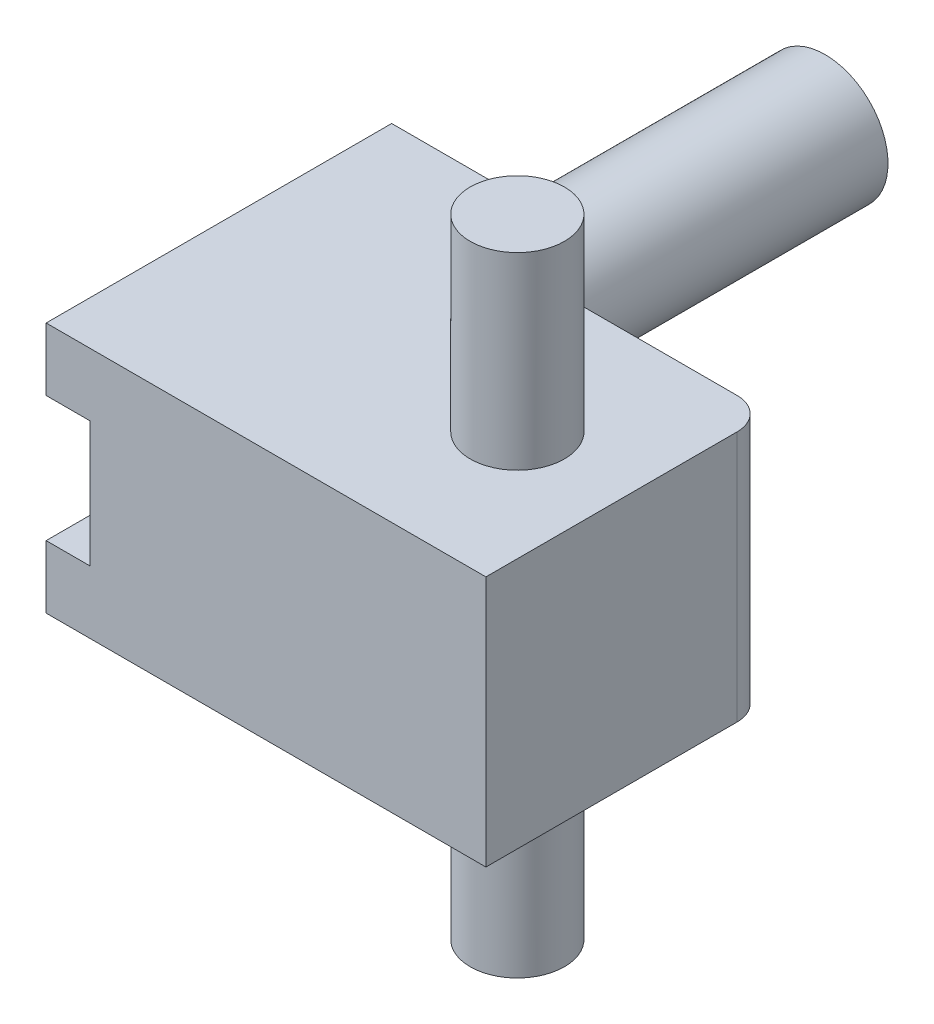
ISO-10303-21;
HEADER;
FILE_DESCRIPTION(('STEP AP214'),'2;1');
FILE_NAME('part.step','',(''),(''),'','','');
FILE_SCHEMA(('AUTOMOTIVE_DESIGN { 1 0 10303 214 1 1 1 1 }'));
ENDSEC;
DATA;
#1=APPLICATION_CONTEXT('core data for automotive mechanical design processes');
#2=APPLICATION_PROTOCOL_DEFINITION('international standard','automotive_design',2000,#1);
#3=PRODUCT_CONTEXT('',#1,'mechanical');
#4=PRODUCT('Part','Part','',(#3));
#5=PRODUCT_RELATED_PRODUCT_CATEGORY('part','',(#4));
#6=PRODUCT_DEFINITION_FORMATION('','',#4);
#7=PRODUCT_DEFINITION_CONTEXT('part definition',#1,'design');
#8=PRODUCT_DEFINITION('design','',#6,#7);
#9=PRODUCT_DEFINITION_SHAPE('','',#8);
#10=(LENGTH_UNIT() NAMED_UNIT(*) SI_UNIT(.MILLI.,.METRE.));
#11=(NAMED_UNIT(*) PLANE_ANGLE_UNIT() SI_UNIT($,.RADIAN.));
#12=(NAMED_UNIT(*) SI_UNIT($,.STERADIAN.) SOLID_ANGLE_UNIT());
#13=UNCERTAINTY_MEASURE_WITH_UNIT(LENGTH_MEASURE(1.E-05),#10,'distance_accuracy_value','');
#14=(GEOMETRIC_REPRESENTATION_CONTEXT(3) GLOBAL_UNCERTAINTY_ASSIGNED_CONTEXT((#13)) GLOBAL_UNIT_ASSIGNED_CONTEXT((#10,
#11,#12)) REPRESENTATION_CONTEXT('',''));
#15=CARTESIAN_POINT('',(0.,0.,0.));
#16=DIRECTION('',(0.,0.,1.));
#17=DIRECTION('',(1.,0.,0.));
#18=AXIS2_PLACEMENT_3D('',#15,#16,#17);
#19=CARTESIAN_POINT('',(65.,40.,5.));
#20=DIRECTION('',(0.,-1.,0.));
#21=DIRECTION('',(0.,0.,-1.));
#22=AXIS2_PLACEMENT_3D('',#19,#20,#21);
#23=CYLINDRICAL_SURFACE('',#22,5.);
#24=DIRECTION('',(0.,1.,0.));
#25=VECTOR('',#24,1.);
#26=CARTESIAN_POINT('',(70.,40.,5.));
#27=LINE('',#26,#25);
#28=CARTESIAN_POINT('',(70.,0.,5.00000000000001));
#29=VERTEX_POINT('',#28);
#30=CARTESIAN_POINT('',(70.,40.,5.00000000000001));
#31=VERTEX_POINT('',#30);
#32=EDGE_CURVE('E397',#29,#31,#27,.T.);
#33=ORIENTED_EDGE('',*,*,#32,.F.);
#34=CARTESIAN_POINT('',(65.,0.,5.));
#35=DIRECTION('',(0.,1.,0.));
#36=DIRECTION('',(-1.,0.,0.));
#37=AXIS2_PLACEMENT_3D('',#34,#35,#36);
#38=CIRCLE('',#37,5.);
#39=CARTESIAN_POINT('',(65.,0.,0.));
#40=VERTEX_POINT('',#39);
#41=EDGE_CURVE('E46',#40,#29,#38,.F.);
#42=ORIENTED_EDGE('',*,*,#41,.F.);
#43=DIRECTION('',(0.,1.,0.));
#44=VECTOR('',#43,1.);
#45=CARTESIAN_POINT('',(65.,40.,0.));
#46=LINE('',#45,#44);
#47=CARTESIAN_POINT('',(65.,40.,0.));
#48=VERTEX_POINT('',#47);
#49=EDGE_CURVE('E401',#48,#40,#46,.F.);
#50=ORIENTED_EDGE('',*,*,#49,.F.);
#51=CARTESIAN_POINT('',(65.,40.,5.));
#52=DIRECTION('',(0.,-1.,0.));
#53=DIRECTION('',(0.,0.,-1.));
#54=AXIS2_PLACEMENT_3D('',#51,#52,#53);
#55=CIRCLE('',#54,5.);
#56=EDGE_CURVE('E11',#31,#48,#55,.F.);
#57=ORIENTED_EDGE('',*,*,#56,.F.);
#58=EDGE_LOOP('',(#33,#42,#50,#57));
#59=FACE_BOUND('',#58,.T.);
#60=ADVANCED_FACE('F38',(#59),#23,.T.);
#61=CARTESIAN_POINT('',(7.,0.,39.));
#62=DIRECTION('',(1.,0.,0.));
#63=DIRECTION('',(0.,1.,0.));
#64=AXIS2_PLACEMENT_3D('',#61,#62,#63);
#65=PLANE('',#64);
#66=DIRECTION('',(0.,-1.,0.));
#67=VECTOR('',#66,1.);
#68=CARTESIAN_POINT('',(7.,10.,25.));
#69=LINE('',#68,#67);
#70=CARTESIAN_POINT('',(7.,30.,25.));
#71=VERTEX_POINT('',#70);
#72=CARTESIAN_POINT('',(7.,10.,25.));
#73=VERTEX_POINT('',#72);
#74=EDGE_CURVE('E250',#71,#73,#69,.T.);
#75=ORIENTED_EDGE('',*,*,#74,.T.);
#76=DIRECTION('',(0.,0.,-1.));
#77=VECTOR('',#76,1.);
#78=CARTESIAN_POINT('',(7.,10.,39.));
#79=LINE('',#78,#77);
#80=CARTESIAN_POINT('',(7.,10.,12.));
#81=VERTEX_POINT('',#80);
#82=EDGE_CURVE('E356',#73,#81,#79,.T.);
#83=ORIENTED_EDGE('',*,*,#82,.T.);
#84=DIRECTION('',(0.,-1.,0.));
#85=VECTOR('',#84,1.);
#86=CARTESIAN_POINT('',(7.,30.,12.));
#87=LINE('',#86,#85);
#88=CARTESIAN_POINT('',(7.,30.,12.));
#89=VERTEX_POINT('',#88);
#90=EDGE_CURVE('E281',#89,#81,#87,.T.);
#91=ORIENTED_EDGE('',*,*,#90,.F.);
#92=DIRECTION('',(0.,0.,-1.));
#93=VECTOR('',#92,1.);
#94=CARTESIAN_POINT('',(7.,30.,39.));
#95=LINE('',#94,#93);
#96=EDGE_CURVE('E353',#71,#89,#95,.T.);
#97=ORIENTED_EDGE('',*,*,#96,.F.);
#98=EDGE_LOOP('',(#75,#83,#91,#97));
#99=FACE_BOUND('',#98,.T.);
#100=ADVANCED_FACE('F463',(#99),#65,.T.);
#101=CARTESIAN_POINT('',(0.,0.,0.));
#102=DIRECTION('',(0.,0.,-1.));
#103=DIRECTION('',(-1.,0.,0.));
#104=AXIS2_PLACEMENT_3D('',#101,#102,#103);
#105=PLANE('',#104);
#106=DIRECTION('',(-1.,0.,0.));
#107=VECTOR('',#106,1.);
#108=CARTESIAN_POINT('',(0.,40.,0.));
#109=LINE('',#108,#107);
#110=CARTESIAN_POINT('',(30.,40.,0.));
#111=VERTEX_POINT('',#110);
#112=EDGE_CURVE('E367',#48,#111,#109,.T.);
#113=ORIENTED_EDGE('',*,*,#112,.F.);
#114=ORIENTED_EDGE('',*,*,#49,.T.);
#115=DIRECTION('',(1.,0.,0.));
#116=VECTOR('',#115,1.);
#117=CARTESIAN_POINT('',(70.,0.,0.));
#118=LINE('',#117,#116);
#119=CARTESIAN_POINT('',(30.,0.,0.));
#120=VERTEX_POINT('',#119);
#121=EDGE_CURVE('E352',#120,#40,#118,.T.);
#122=ORIENTED_EDGE('',*,*,#121,.F.);
#123=DIRECTION('',(0.,-1.,0.));
#124=VECTOR('',#123,1.);
#125=CARTESIAN_POINT('',(30.,40.,0.));
#126=LINE('',#125,#124);
#127=CARTESIAN_POINT('',(30.,10.,0.));
#128=VERTEX_POINT('',#127);
#129=EDGE_CURVE('E209',#128,#120,#126,.T.);
#130=ORIENTED_EDGE('',*,*,#129,.F.);
#131=DIRECTION('',(1.,0.,0.));
#132=VECTOR('',#131,1.);
#133=CARTESIAN_POINT('',(0.,10.,0.));
#134=LINE('',#133,#132);
#135=CARTESIAN_POINT('',(54.5,10.,0.));
#136=VERTEX_POINT('',#135);
#137=EDGE_CURVE('E298',#128,#136,#134,.T.);
#138=ORIENTED_EDGE('',*,*,#137,.T.);
#139=DIRECTION('',(0.,1.,0.));
#140=VECTOR('',#139,1.);
#141=CARTESIAN_POINT('',(54.5,10.,0.));
#142=LINE('',#141,#140);
#143=CARTESIAN_POINT('',(54.5,30.,0.));
#144=VERTEX_POINT('',#143);
#145=EDGE_CURVE('E282',#136,#144,#142,.T.);
#146=ORIENTED_EDGE('',*,*,#145,.T.);
#147=DIRECTION('',(1.,0.,0.));
#148=VECTOR('',#147,1.);
#149=CARTESIAN_POINT('',(0.,30.,0.));
#150=LINE('',#149,#148);
#151=CARTESIAN_POINT('',(30.,30.,0.));
#152=VERTEX_POINT('',#151);
#153=EDGE_CURVE('E345',#152,#144,#150,.T.);
#154=ORIENTED_EDGE('',*,*,#153,.F.);
#155=EDGE_CURVE('E203',#111,#152,#126,.T.);
#156=ORIENTED_EDGE('',*,*,#155,.F.);
#157=EDGE_LOOP('',(#113,#114,#122,#130,#138,#146,#154,#156));
#158=FACE_BOUND('',#157,.T.);
#159=ADVANCED_FACE('F422',(#158),#105,.T.);
#160=CARTESIAN_POINT('',(70.,0.,45.));
#161=DIRECTION('',(0.,1.,0.));
#162=DIRECTION('',(-1.,0.,0.));
#163=AXIS2_PLACEMENT_3D('',#160,#161,#162);
#164=PLANE('',#163);
#165=CARTESIAN_POINT('',(52.5,0.,22.5));
#166=DIRECTION('',(0.,1.,0.));
#167=DIRECTION('',(-1.,0.,0.));
#168=AXIS2_PLACEMENT_3D('',#165,#166,#167);
#169=CIRCLE('',#168,7.5);
#170=CARTESIAN_POINT('',(45.,0.,22.5));
#171=VERTEX_POINT('',#170);
#172=EDGE_CURVE('E393',#171,#171,#169,.F.);
#173=ORIENTED_EDGE('',*,*,#172,.F.);
#174=EDGE_LOOP('',(#173));
#175=FACE_BOUND('',#174,.T.);
#176=ORIENTED_EDGE('',*,*,#121,.T.);
#177=ORIENTED_EDGE('',*,*,#41,.T.);
#178=DIRECTION('',(0.,0.,-1.));
#179=VECTOR('',#178,1.);
#180=CARTESIAN_POINT('',(70.,0.,45.));
#181=LINE('',#180,#179);
#182=CARTESIAN_POINT('',(70.,0.,45.));
#183=VERTEX_POINT('',#182);
#184=EDGE_CURVE('E385',#183,#29,#181,.T.);
#185=ORIENTED_EDGE('',*,*,#184,.F.);
#186=DIRECTION('',(1.,0.,0.));
#187=VECTOR('',#186,1.);
#188=CARTESIAN_POINT('',(70.,0.,45.));
#189=LINE('',#188,#187);
#190=CARTESIAN_POINT('',(0.,0.,45.));
#191=VERTEX_POINT('',#190);
#192=EDGE_CURVE('E362',#191,#183,#189,.T.);
#193=ORIENTED_EDGE('',*,*,#192,.F.);
#194=DIRECTION('',(0.,0.,-1.));
#195=VECTOR('',#194,1.);
#196=CARTESIAN_POINT('',(0.,0.,45.));
#197=LINE('',#196,#195);
#198=CARTESIAN_POINT('',(0.,0.,-10.));
#199=VERTEX_POINT('',#198);
#200=EDGE_CURVE('E186',#191,#199,#197,.T.);
#201=ORIENTED_EDGE('',*,*,#200,.T.);
#202=DIRECTION('',(-1.,0.,0.));
#203=VECTOR('',#202,1.);
#204=CARTESIAN_POINT('',(30.,0.,-10.));
#205=LINE('',#204,#203);
#206=CARTESIAN_POINT('',(30.,0.,-10.));
#207=VERTEX_POINT('',#206);
#208=EDGE_CURVE('E201',#207,#199,#205,.T.);
#209=ORIENTED_EDGE('',*,*,#208,.F.);
#210=DIRECTION('',(0.,0.,1.));
#211=VECTOR('',#210,1.);
#212=CARTESIAN_POINT('',(30.,0.,-10.));
#213=LINE('',#212,#211);
#214=EDGE_CURVE('E218',#207,#120,#213,.T.);
#215=ORIENTED_EDGE('',*,*,#214,.T.);
#216=EDGE_LOOP('',(#176,#177,#185,#193,#201,#209,#215));
#217=FACE_BOUND('',#216,.T.);
#218=ADVANCED_FACE('F406',(#175,#217),#164,.F.);
#219=CARTESIAN_POINT('',(70.,40.,45.));
#220=DIRECTION('',(-1.,0.,0.));
#221=DIRECTION('',(0.,0.,1.));
#222=AXIS2_PLACEMENT_3D('',#219,#220,#221);
#223=PLANE('',#222);
#224=ORIENTED_EDGE('',*,*,#184,.T.);
#225=ORIENTED_EDGE('',*,*,#32,.T.);
#226=DIRECTION('',(0.,0.,-1.));
#227=VECTOR('',#226,1.);
#228=CARTESIAN_POINT('',(70.,40.,45.));
#229=LINE('',#228,#227);
#230=CARTESIAN_POINT('',(70.,40.,45.));
#231=VERTEX_POINT('',#230);
#232=EDGE_CURVE('E185',#231,#31,#229,.T.);
#233=ORIENTED_EDGE('',*,*,#232,.F.);
#234=DIRECTION('',(0.,1.,0.));
#235=VECTOR('',#234,1.);
#236=CARTESIAN_POINT('',(70.,40.,45.));
#237=LINE('',#236,#235);
#238=EDGE_CURVE('E366',#183,#231,#237,.T.);
#239=ORIENTED_EDGE('',*,*,#238,.F.);
#240=EDGE_LOOP('',(#224,#225,#233,#239));
#241=FACE_BOUND('',#240,.T.);
#242=ADVANCED_FACE('F410',(#241),#223,.F.);
#243=CARTESIAN_POINT('',(0.,40.,45.));
#244=DIRECTION('',(0.,-1.,0.));
#245=DIRECTION('',(0.,0.,-1.));
#246=AXIS2_PLACEMENT_3D('',#243,#244,#245);
#247=PLANE('',#246);
#248=CARTESIAN_POINT('',(52.5,40.,22.5));
#249=DIRECTION('',(0.,-1.,0.));
#250=DIRECTION('',(0.,0.,-1.));
#251=AXIS2_PLACEMENT_3D('',#248,#249,#250);
#252=CIRCLE('',#251,7.5);
#253=CARTESIAN_POINT('',(52.5,40.,15.));
#254=VERTEX_POINT('',#253);
#255=EDGE_CURVE('E389',#254,#254,#252,.F.);
#256=ORIENTED_EDGE('',*,*,#255,.F.);
#257=EDGE_LOOP('',(#256));
#258=FACE_BOUND('',#257,.T.);
#259=ORIENTED_EDGE('',*,*,#232,.T.);
#260=ORIENTED_EDGE('',*,*,#56,.T.);
#261=ORIENTED_EDGE('',*,*,#112,.T.);
#262=DIRECTION('',(0.,0.,1.));
#263=VECTOR('',#262,1.);
#264=CARTESIAN_POINT('',(30.,40.,-10.));
#265=LINE('',#264,#263);
#266=CARTESIAN_POINT('',(30.,40.,-10.));
#267=VERTEX_POINT('',#266);
#268=EDGE_CURVE('E192',#267,#111,#265,.T.);
#269=ORIENTED_EDGE('',*,*,#268,.F.);
#270=DIRECTION('',(1.,0.,0.));
#271=VECTOR('',#270,1.);
#272=CARTESIAN_POINT('',(0.,40.,-10.));
#273=LINE('',#272,#271);
#274=CARTESIAN_POINT('',(0.,40.,-10.));
#275=VERTEX_POINT('',#274);
#276=EDGE_CURVE('E189',#275,#267,#273,.T.);
#277=ORIENTED_EDGE('',*,*,#276,.F.);
#278=DIRECTION('',(0.,0.,-1.));
#279=VECTOR('',#278,1.);
#280=CARTESIAN_POINT('',(0.,40.,45.));
#281=LINE('',#280,#279);
#282=CARTESIAN_POINT('',(0.,40.,45.));
#283=VERTEX_POINT('',#282);
#284=EDGE_CURVE('E173',#283,#275,#281,.T.);
#285=ORIENTED_EDGE('',*,*,#284,.F.);
#286=DIRECTION('',(-1.,0.,0.));
#287=VECTOR('',#286,1.);
#288=CARTESIAN_POINT('',(0.,40.,45.));
#289=LINE('',#288,#287);
#290=EDGE_CURVE('E370',#231,#283,#289,.T.);
#291=ORIENTED_EDGE('',*,*,#290,.F.);
#292=EDGE_LOOP('',(#259,#260,#261,#269,#277,#285,#291));
#293=FACE_BOUND('',#292,.T.);
#294=ADVANCED_FACE('F190',(#258,#293),#247,.F.);
#295=CARTESIAN_POINT('',(0.,0.,45.));
#296=DIRECTION('',(1.,0.,0.));
#297=DIRECTION('',(0.,0.,-1.));
#298=AXIS2_PLACEMENT_3D('',#295,#296,#297);
#299=PLANE('',#298);
#300=DIRECTION('',(0.,1.,0.));
#301=VECTOR('',#300,1.);
#302=CARTESIAN_POINT('',(0.,0.,0.));
#303=LINE('',#302,#301);
#304=CARTESIAN_POINT('',(0.,10.,0.));
#305=VERTEX_POINT('',#304);
#306=CARTESIAN_POINT('',(0.,30.,0.));
#307=VERTEX_POINT('',#306);
#308=EDGE_CURVE('E219',#305,#307,#303,.T.);
#309=ORIENTED_EDGE('',*,*,#308,.T.);
#310=DIRECTION('',(0.,0.,-1.));
#311=VECTOR('',#310,1.);
#312=CARTESIAN_POINT('',(0.,30.,12.));
#313=LINE('',#312,#311);
#314=CARTESIAN_POINT('',(0.,30.,12.));
#315=VERTEX_POINT('',#314);
#316=EDGE_CURVE('E295',#315,#307,#313,.T.);
#317=ORIENTED_EDGE('',*,*,#316,.F.);
#318=DIRECTION('',(0.,1.,0.));
#319=VECTOR('',#318,1.);
#320=CARTESIAN_POINT('',(0.,10.,12.));
#321=LINE('',#320,#319);
#322=CARTESIAN_POINT('',(0.,10.,12.));
#323=VERTEX_POINT('',#322);
#324=EDGE_CURVE('E290',#323,#315,#321,.T.);
#325=ORIENTED_EDGE('',*,*,#324,.F.);
#326=DIRECTION('',(0.,0.,-1.));
#327=VECTOR('',#326,1.);
#328=CARTESIAN_POINT('',(0.,10.,12.));
#329=LINE('',#328,#327);
#330=EDGE_CURVE('E294',#323,#305,#329,.T.);
#331=ORIENTED_EDGE('',*,*,#330,.T.);
#332=EDGE_LOOP('',(#309,#317,#325,#331));
#333=FACE_BOUND('',#332,.T.);
#334=DIRECTION('',(0.,-1.,0.));
#335=VECTOR('',#334,1.);
#336=CARTESIAN_POINT('',(0.,0.,45.));
#337=LINE('',#336,#335);
#338=CARTESIAN_POINT('',(0.,10.,45.));
#339=VERTEX_POINT('',#338);
#340=EDGE_CURVE('E373',#339,#191,#337,.T.);
#341=ORIENTED_EDGE('',*,*,#340,.F.);
#342=DIRECTION('',(0.,0.,1.));
#343=VECTOR('',#342,1.);
#344=CARTESIAN_POINT('',(0.,10.,25.));
#345=LINE('',#344,#343);
#346=CARTESIAN_POINT('',(0.,10.,25.));
#347=VERTEX_POINT('',#346);
#348=EDGE_CURVE('E237',#347,#339,#345,.T.);
#349=ORIENTED_EDGE('',*,*,#348,.F.);
#350=DIRECTION('',(0.,-1.,0.));
#351=VECTOR('',#350,1.);
#352=CARTESIAN_POINT('',(0.,10.,25.));
#353=LINE('',#352,#351);
#354=CARTESIAN_POINT('',(0.,30.,25.));
#355=VERTEX_POINT('',#354);
#356=EDGE_CURVE('E243',#355,#347,#353,.T.);
#357=ORIENTED_EDGE('',*,*,#356,.F.);
#358=DIRECTION('',(0.,0.,-1.));
#359=VECTOR('',#358,1.);
#360=CARTESIAN_POINT('',(0.,30.,45.));
#361=LINE('',#360,#359);
#362=CARTESIAN_POINT('',(0.,30.,45.));
#363=VERTEX_POINT('',#362);
#364=EDGE_CURVE('E257',#363,#355,#361,.T.);
#365=ORIENTED_EDGE('',*,*,#364,.F.);
#366=EDGE_CURVE('E182',#283,#363,#337,.T.);
#367=ORIENTED_EDGE('',*,*,#366,.F.);
#368=ORIENTED_EDGE('',*,*,#284,.T.);
#369=DIRECTION('',(0.,1.,0.));
#370=VECTOR('',#369,1.);
#371=CARTESIAN_POINT('',(0.,0.,-10.));
#372=LINE('',#371,#370);
#373=EDGE_CURVE('E179',#199,#275,#372,.T.);
#374=ORIENTED_EDGE('',*,*,#373,.F.);
#375=ORIENTED_EDGE('',*,*,#200,.F.);
#376=EDGE_LOOP('',(#341,#349,#357,#365,#367,#368,#374,#375));
#377=FACE_BOUND('',#376,.T.);
#378=ADVANCED_FACE('F176',(#333,#377),#299,.F.);
#379=CARTESIAN_POINT('',(0.,0.,45.));
#380=DIRECTION('',(0.,0.,-1.));
#381=DIRECTION('',(-1.,0.,0.));
#382=AXIS2_PLACEMENT_3D('',#379,#380,#381);
#383=PLANE('',#382);
#384=DIRECTION('',(0.,1.,0.));
#385=VECTOR('',#384,1.);
#386=CARTESIAN_POINT('',(7.,10.,45.));
#387=LINE('',#386,#385);
#388=CARTESIAN_POINT('',(7.,10.,45.));
#389=VERTEX_POINT('',#388);
#390=CARTESIAN_POINT('',(7.,30.,45.));
#391=VERTEX_POINT('',#390);
#392=EDGE_CURVE('E242',#389,#391,#387,.T.);
#393=ORIENTED_EDGE('',*,*,#392,.F.);
#394=DIRECTION('',(-1.,0.,0.));
#395=VECTOR('',#394,1.);
#396=CARTESIAN_POINT('',(7.,10.,45.));
#397=LINE('',#396,#395);
#398=EDGE_CURVE('E254',#389,#339,#397,.T.);
#399=ORIENTED_EDGE('',*,*,#398,.T.);
#400=ORIENTED_EDGE('',*,*,#340,.T.);
#401=ORIENTED_EDGE('',*,*,#192,.T.);
#402=ORIENTED_EDGE('',*,*,#238,.T.);
#403=ORIENTED_EDGE('',*,*,#290,.T.);
#404=ORIENTED_EDGE('',*,*,#366,.T.);
#405=DIRECTION('',(-1.,0.,0.));
#406=VECTOR('',#405,1.);
#407=CARTESIAN_POINT('',(7.,30.,45.));
#408=LINE('',#407,#406);
#409=EDGE_CURVE('E271',#391,#363,#408,.T.);
#410=ORIENTED_EDGE('',*,*,#409,.F.);
#411=EDGE_LOOP('',(#393,#399,#400,#401,#402,#403,#404,#410));
#412=FACE_BOUND('',#411,.T.);
#413=ADVANCED_FACE('F413',(#412),#383,.F.);
#414=CARTESIAN_POINT('',(47.5,0.,39.));
#415=DIRECTION('',(-1.,0.,0.));
#416=DIRECTION('',(0.,0.,1.));
#417=AXIS2_PLACEMENT_3D('',#414,#415,#416);
#418=PLANE('',#417);
#419=DIRECTION('',(0.,1.,0.));
#420=VECTOR('',#419,1.);
#421=CARTESIAN_POINT('',(47.5,10.,12.));
#422=LINE('',#421,#420);
#423=CARTESIAN_POINT('',(47.5,10.,12.));
#424=VERTEX_POINT('',#423);
#425=CARTESIAN_POINT('',(47.5,30.,12.));
#426=VERTEX_POINT('',#425);
#427=EDGE_CURVE('E306',#424,#426,#422,.T.);
#428=ORIENTED_EDGE('',*,*,#427,.F.);
#429=DIRECTION('',(0.,0.,-1.));
#430=VECTOR('',#429,1.);
#431=CARTESIAN_POINT('',(47.5,9.99999999999999,39.));
#432=LINE('',#431,#430);
#433=CARTESIAN_POINT('',(47.5,9.99999999999999,39.));
#434=VERTEX_POINT('',#433);
#435=EDGE_CURVE('E340',#434,#424,#432,.T.);
#436=ORIENTED_EDGE('',*,*,#435,.F.);
#437=DIRECTION('',(0.,1.,0.));
#438=VECTOR('',#437,1.);
#439=CARTESIAN_POINT('',(47.5,0.,39.));
#440=LINE('',#439,#438);
#441=CARTESIAN_POINT('',(47.5,30.,39.));
#442=VERTEX_POINT('',#441);
#443=EDGE_CURVE('E326',#434,#442,#440,.T.);
#444=ORIENTED_EDGE('',*,*,#443,.T.);
#445=DIRECTION('',(0.,0.,-1.));
#446=VECTOR('',#445,1.);
#447=CARTESIAN_POINT('',(47.5,30.,39.));
#448=LINE('',#447,#446);
#449=EDGE_CURVE('E348',#442,#426,#448,.T.);
#450=ORIENTED_EDGE('',*,*,#449,.T.);
#451=EDGE_LOOP('',(#428,#436,#444,#450));
#452=FACE_BOUND('',#451,.T.);
#453=ADVANCED_FACE('F441',(#452),#418,.T.);
#454=CARTESIAN_POINT('',(0.,30.,39.));
#455=DIRECTION('',(0.,1.,0.));
#456=DIRECTION('',(-1.,0.,0.));
#457=AXIS2_PLACEMENT_3D('',#454,#455,#456);
#458=PLANE('',#457);
#459=EDGE_CURVE('E330',#307,#152,#150,.T.);
#460=ORIENTED_EDGE('',*,*,#459,.T.);
#461=ORIENTED_EDGE('',*,*,#153,.T.);
#462=DIRECTION('',(0.,0.,-1.));
#463=VECTOR('',#462,1.);
#464=CARTESIAN_POINT('',(54.5,30.,12.));
#465=LINE('',#464,#463);
#466=CARTESIAN_POINT('',(54.5,30.,12.));
#467=VERTEX_POINT('',#466);
#468=EDGE_CURVE('E302',#467,#144,#465,.T.);
#469=ORIENTED_EDGE('',*,*,#468,.F.);
#470=DIRECTION('',(1.,0.,0.));
#471=VECTOR('',#470,1.);
#472=CARTESIAN_POINT('',(47.5,30.,12.));
#473=LINE('',#472,#471);
#474=EDGE_CURVE('E313',#426,#467,#473,.T.);
#475=ORIENTED_EDGE('',*,*,#474,.F.);
#476=ORIENTED_EDGE('',*,*,#449,.F.);
#477=DIRECTION('',(1.,0.,0.));
#478=VECTOR('',#477,1.);
#479=CARTESIAN_POINT('',(0.,30.,39.));
#480=LINE('',#479,#478);
#481=CARTESIAN_POINT('',(7.,30.,39.));
#482=VERTEX_POINT('',#481);
#483=EDGE_CURVE('E336',#482,#442,#480,.T.);
#484=ORIENTED_EDGE('',*,*,#483,.F.);
#485=DIRECTION('',(0.,0.,-1.));
#486=VECTOR('',#485,1.);
#487=CARTESIAN_POINT('',(7.,30.,45.));
#488=LINE('',#487,#486);
#489=EDGE_CURVE('E247',#391,#482,#488,.T.);
#490=ORIENTED_EDGE('',*,*,#489,.F.);
#491=ORIENTED_EDGE('',*,*,#409,.T.);
#492=ORIENTED_EDGE('',*,*,#364,.T.);
#493=DIRECTION('',(-1.,0.,0.));
#494=VECTOR('',#493,1.);
#495=CARTESIAN_POINT('',(7.,30.,25.));
#496=LINE('',#495,#494);
#497=EDGE_CURVE('E268',#71,#355,#496,.T.);
#498=ORIENTED_EDGE('',*,*,#497,.F.);
#499=ORIENTED_EDGE('',*,*,#96,.T.);
#500=DIRECTION('',(1.,0.,0.));
#501=VECTOR('',#500,1.);
#502=CARTESIAN_POINT('',(0.,30.,12.));
#503=LINE('',#502,#501);
#504=EDGE_CURVE('E277',#315,#89,#503,.T.);
#505=ORIENTED_EDGE('',*,*,#504,.F.);
#506=ORIENTED_EDGE('',*,*,#316,.T.);
#507=EDGE_LOOP('',(#460,#461,#469,#475,#476,#484,#490,#491,#492,#498,#499,#505,#506));
#508=FACE_BOUND('',#507,.T.);
#509=ADVANCED_FACE('F434',(#508),#458,.F.);
#510=CARTESIAN_POINT('',(0.,10.,39.));
#511=DIRECTION('',(0.,1.,0.));
#512=DIRECTION('',(-1.,0.,0.));
#513=AXIS2_PLACEMENT_3D('',#510,#511,#512);
#514=PLANE('',#513);
#515=EDGE_CURVE('E341',#305,#128,#134,.T.);
#516=ORIENTED_EDGE('',*,*,#515,.F.);
#517=ORIENTED_EDGE('',*,*,#330,.F.);
#518=DIRECTION('',(-1.,0.,0.));
#519=VECTOR('',#518,1.);
#520=CARTESIAN_POINT('',(7.,10.,12.));
#521=LINE('',#520,#519);
#522=EDGE_CURVE('E286',#81,#323,#521,.T.);
#523=ORIENTED_EDGE('',*,*,#522,.F.);
#524=ORIENTED_EDGE('',*,*,#82,.F.);
#525=DIRECTION('',(-1.,0.,0.));
#526=VECTOR('',#525,1.);
#527=CARTESIAN_POINT('',(7.,10.,25.));
#528=LINE('',#527,#526);
#529=EDGE_CURVE('E264',#73,#347,#528,.T.);
#530=ORIENTED_EDGE('',*,*,#529,.T.);
#531=ORIENTED_EDGE('',*,*,#348,.T.);
#532=ORIENTED_EDGE('',*,*,#398,.F.);
#533=DIRECTION('',(0.,0.,1.));
#534=VECTOR('',#533,1.);
#535=CARTESIAN_POINT('',(7.,10.,25.));
#536=LINE('',#535,#534);
#537=CARTESIAN_POINT('',(7.,10.,39.));
#538=VERTEX_POINT('',#537);
#539=EDGE_CURVE('E238',#538,#389,#536,.T.);
#540=ORIENTED_EDGE('',*,*,#539,.F.);
#541=DIRECTION('',(1.,0.,0.));
#542=VECTOR('',#541,1.);
#543=CARTESIAN_POINT('',(0.,10.,39.));
#544=LINE('',#543,#542);
#545=EDGE_CURVE('E329',#538,#434,#544,.T.);
#546=ORIENTED_EDGE('',*,*,#545,.T.);
#547=ORIENTED_EDGE('',*,*,#435,.T.);
#548=DIRECTION('',(1.,0.,0.));
#549=VECTOR('',#548,1.);
#550=CARTESIAN_POINT('',(47.5,10.,12.));
#551=LINE('',#550,#549);
#552=CARTESIAN_POINT('',(54.5,10.,12.));
#553=VERTEX_POINT('',#552);
#554=EDGE_CURVE('E317',#424,#553,#551,.T.);
#555=ORIENTED_EDGE('',*,*,#554,.T.);
#556=DIRECTION('',(0.,0.,-1.));
#557=VECTOR('',#556,1.);
#558=CARTESIAN_POINT('',(54.5,10.,12.));
#559=LINE('',#558,#557);
#560=EDGE_CURVE('E267',#553,#136,#559,.T.);
#561=ORIENTED_EDGE('',*,*,#560,.T.);
#562=ORIENTED_EDGE('',*,*,#137,.F.);
#563=EDGE_LOOP('',(#516,#517,#523,#524,#530,#531,#532,#540,#546,#547,#555,#561,#562));
#564=FACE_BOUND('',#563,.T.);
#565=ADVANCED_FACE('F428',(#564),#514,.T.);
#566=CARTESIAN_POINT('',(0.,0.,39.));
#567=DIRECTION('',(0.,0.,-1.));
#568=DIRECTION('',(-1.,0.,0.));
#569=AXIS2_PLACEMENT_3D('',#566,#567,#568);
#570=PLANE('',#569);
#571=ORIENTED_EDGE('',*,*,#443,.F.);
#572=ORIENTED_EDGE('',*,*,#545,.F.);
#573=DIRECTION('',(0.,-1.,0.));
#574=VECTOR('',#573,1.);
#575=CARTESIAN_POINT('',(7.,0.,39.));
#576=LINE('',#575,#574);
#577=EDGE_CURVE('E333',#482,#538,#576,.T.);
#578=ORIENTED_EDGE('',*,*,#577,.F.);
#579=ORIENTED_EDGE('',*,*,#483,.T.);
#580=EDGE_LOOP('',(#571,#572,#578,#579));
#581=FACE_BOUND('',#580,.T.);
#582=ADVANCED_FACE('F446',(#581),#570,.T.);
#583=CARTESIAN_POINT('',(54.5,10.,12.));
#584=DIRECTION('',(-1.,0.,0.));
#585=DIRECTION('',(0.,0.,1.));
#586=AXIS2_PLACEMENT_3D('',#583,#584,#585);
#587=PLANE('',#586);
#588=ORIENTED_EDGE('',*,*,#145,.F.);
#589=ORIENTED_EDGE('',*,*,#560,.F.);
#590=DIRECTION('',(0.,1.,0.));
#591=VECTOR('',#590,1.);
#592=CARTESIAN_POINT('',(54.5,10.,12.));
#593=LINE('',#592,#591);
#594=EDGE_CURVE('E320',#553,#467,#593,.T.);
#595=ORIENTED_EDGE('',*,*,#594,.T.);
#596=ORIENTED_EDGE('',*,*,#468,.T.);
#597=EDGE_LOOP('',(#588,#589,#595,#596));
#598=FACE_BOUND('',#597,.T.);
#599=ADVANCED_FACE('F431',(#598),#587,.T.);
#600=CARTESIAN_POINT('',(0.,0.,12.));
#601=DIRECTION('',(0.,0.,1.));
#602=DIRECTION('',(1.,0.,0.));
#603=AXIS2_PLACEMENT_3D('',#600,#601,#602);
#604=PLANE('',#603);
#605=ORIENTED_EDGE('',*,*,#474,.T.);
#606=ORIENTED_EDGE('',*,*,#594,.F.);
#607=ORIENTED_EDGE('',*,*,#554,.F.);
#608=ORIENTED_EDGE('',*,*,#427,.T.);
#609=EDGE_LOOP('',(#605,#606,#607,#608));
#610=FACE_BOUND('',#609,.T.);
#611=ADVANCED_FACE('F437',(#610),#604,.F.);
#612=CARTESIAN_POINT('',(0.,0.,12.));
#613=DIRECTION('',(0.,0.,-1.));
#614=DIRECTION('',(-1.,0.,0.));
#615=AXIS2_PLACEMENT_3D('',#612,#613,#614);
#616=PLANE('',#615);
#617=ORIENTED_EDGE('',*,*,#504,.T.);
#618=ORIENTED_EDGE('',*,*,#90,.T.);
#619=ORIENTED_EDGE('',*,*,#522,.T.);
#620=ORIENTED_EDGE('',*,*,#324,.T.);
#621=EDGE_LOOP('',(#617,#618,#619,#620));
#622=FACE_BOUND('',#621,.T.);
#623=ADVANCED_FACE('F459',(#622),#616,.T.);
#624=CARTESIAN_POINT('',(7.,10.,25.));
#625=DIRECTION('',(0.,0.,-1.));
#626=DIRECTION('',(-1.,0.,0.));
#627=AXIS2_PLACEMENT_3D('',#624,#625,#626);
#628=PLANE('',#627);
#629=ORIENTED_EDGE('',*,*,#356,.T.);
#630=ORIENTED_EDGE('',*,*,#529,.F.);
#631=ORIENTED_EDGE('',*,*,#74,.F.);
#632=ORIENTED_EDGE('',*,*,#497,.T.);
#633=EDGE_LOOP('',(#629,#630,#631,#632));
#634=FACE_BOUND('',#633,.T.);
#635=ADVANCED_FACE('F453',(#634),#628,.F.);
#636=CARTESIAN_POINT('',(7.,0.,0.));
#637=DIRECTION('',(-1.,0.,0.));
#638=DIRECTION('',(0.,0.,1.));
#639=AXIS2_PLACEMENT_3D('',#636,#637,#638);
#640=PLANE('',#639);
#641=ORIENTED_EDGE('',*,*,#539,.T.);
#642=ORIENTED_EDGE('',*,*,#392,.T.);
#643=ORIENTED_EDGE('',*,*,#489,.T.);
#644=ORIENTED_EDGE('',*,*,#577,.T.);
#645=EDGE_LOOP('',(#641,#642,#643,#644));
#646=FACE_BOUND('',#645,.T.);
#647=ADVANCED_FACE('F450',(#646),#640,.T.);
#648=CARTESIAN_POINT('',(52.5,70.,22.5));
#649=DIRECTION('',(0.,-1.,0.));
#650=DIRECTION('',(0.,0.,-1.));
#651=AXIS2_PLACEMENT_3D('',#648,#649,#650);
#652=CYLINDRICAL_SURFACE('',#651,7.5);
#653=CARTESIAN_POINT('',(52.5,70.,22.5));
#654=DIRECTION('',(0.,1.,0.));
#655=DIRECTION('',(0.,0.,1.));
#656=AXIS2_PLACEMENT_3D('',#653,#654,#655);
#657=CIRCLE('',#656,7.5);
#658=CARTESIAN_POINT('',(52.5,70.,30.));
#659=VERTEX_POINT('',#658);
#660=EDGE_CURVE('E233',#659,#659,#657,.T.);
#661=ORIENTED_EDGE('',*,*,#660,.F.);
#662=EDGE_LOOP('',(#661));
#663=FACE_BOUND('',#662,.T.);
#664=ORIENTED_EDGE('',*,*,#255,.T.);
#665=EDGE_LOOP('',(#664));
#666=FACE_BOUND('',#665,.T.);
#667=ADVANCED_FACE('F539',(#663,#666),#652,.T.);
#668=CARTESIAN_POINT('',(52.5,70.,22.5));
#669=DIRECTION('',(0.,1.,0.));
#670=DIRECTION('',(0.,0.,1.));
#671=AXIS2_PLACEMENT_3D('',#668,#669,#670);
#672=PLANE('',#671);
#673=ORIENTED_EDGE('',*,*,#660,.T.);
#674=EDGE_LOOP('',(#673));
#675=FACE_BOUND('',#674,.T.);
#676=ADVANCED_FACE('F530',(#675),#672,.T.);
#677=CARTESIAN_POINT('',(52.5,-30.,22.5));
#678=DIRECTION('',(0.,1.,0.));
#679=DIRECTION('',(-1.,0.,0.));
#680=AXIS2_PLACEMENT_3D('',#677,#678,#679);
#681=CYLINDRICAL_SURFACE('',#680,7.5);
#682=CARTESIAN_POINT('',(52.5,-30.,22.5));
#683=DIRECTION('',(0.,-1.,0.));
#684=DIRECTION('',(1.,0.,0.));
#685=AXIS2_PLACEMENT_3D('',#682,#683,#684);
#686=CIRCLE('',#685,7.5);
#687=CARTESIAN_POINT('',(60.,-30.,22.5));
#688=VERTEX_POINT('',#687);
#689=EDGE_CURVE('E229',#688,#688,#686,.T.);
#690=ORIENTED_EDGE('',*,*,#689,.F.);
#691=EDGE_LOOP('',(#690));
#692=FACE_BOUND('',#691,.T.);
#693=ORIENTED_EDGE('',*,*,#172,.T.);
#694=EDGE_LOOP('',(#693));
#695=FACE_BOUND('',#694,.T.);
#696=ADVANCED_FACE('F527',(#692,#695),#681,.T.);
#697=CARTESIAN_POINT('',(52.5,-30.,22.5));
#698=DIRECTION('',(0.,-1.,0.));
#699=DIRECTION('',(1.,0.,0.));
#700=AXIS2_PLACEMENT_3D('',#697,#698,#699);
#701=PLANE('',#700);
#702=ORIENTED_EDGE('',*,*,#689,.T.);
#703=EDGE_LOOP('',(#702));
#704=FACE_BOUND('',#703,.T.);
#705=ADVANCED_FACE('F529',(#704),#701,.T.);
#706=CARTESIAN_POINT('',(0.,0.,0.));
#707=DIRECTION('',(0.,0.,-1.));
#708=DIRECTION('',(-1.,0.,0.));
#709=AXIS2_PLACEMENT_3D('',#706,#707,#708);
#710=PLANE('',#709);
#711=ORIENTED_EDGE('',*,*,#459,.F.);
#712=ORIENTED_EDGE('',*,*,#308,.F.);
#713=ORIENTED_EDGE('',*,*,#515,.T.);
#714=EDGE_CURVE('E207',#152,#128,#126,.T.);
#715=ORIENTED_EDGE('',*,*,#714,.F.);
#716=EDGE_LOOP('',(#711,#712,#713,#715));
#717=FACE_BOUND('',#716,.T.);
#718=ADVANCED_FACE('F470',(#717),#710,.F.);
#719=CARTESIAN_POINT('',(30.,40.,-10.));
#720=DIRECTION('',(-1.,0.,0.));
#721=DIRECTION('',(0.,-1.,0.));
#722=AXIS2_PLACEMENT_3D('',#719,#720,#721);
#723=PLANE('',#722);
#724=ORIENTED_EDGE('',*,*,#155,.T.);
#725=ORIENTED_EDGE('',*,*,#714,.T.);
#726=ORIENTED_EDGE('',*,*,#129,.T.);
#727=ORIENTED_EDGE('',*,*,#214,.F.);
#728=DIRECTION('',(0.,-1.,0.));
#729=VECTOR('',#728,1.);
#730=CARTESIAN_POINT('',(30.,40.,-10.));
#731=LINE('',#730,#729);
#732=EDGE_CURVE('E196',#267,#207,#731,.T.);
#733=ORIENTED_EDGE('',*,*,#732,.F.);
#734=ORIENTED_EDGE('',*,*,#268,.T.);
#735=EDGE_LOOP('',(#724,#725,#726,#727,#733,#734));
#736=FACE_BOUND('',#735,.T.);
#737=ADVANCED_FACE('F475',(#736),#723,.F.);
#738=CARTESIAN_POINT('',(0.,0.,-10.));
#739=DIRECTION('',(0.,0.,-1.));
#740=DIRECTION('',(-1.,0.,0.));
#741=AXIS2_PLACEMENT_3D('',#738,#739,#740);
#742=PLANE('',#741);
#743=CARTESIAN_POINT('',(15.,20.,-10.));
#744=DIRECTION('',(0.,0.,-1.));
#745=DIRECTION('',(-1.,0.,0.));
#746=AXIS2_PLACEMENT_3D('',#743,#744,#745);
#747=CIRCLE('',#746,10.);
#748=CARTESIAN_POINT('',(5.,20.,-10.));
#749=VERTEX_POINT('',#748);
#750=EDGE_CURVE('E211',#749,#749,#747,.T.);
#751=ORIENTED_EDGE('',*,*,#750,.F.);
#752=EDGE_LOOP('',(#751));
#753=FACE_BOUND('',#752,.T.);
#754=ORIENTED_EDGE('',*,*,#373,.T.);
#755=ORIENTED_EDGE('',*,*,#276,.T.);
#756=ORIENTED_EDGE('',*,*,#732,.T.);
#757=ORIENTED_EDGE('',*,*,#208,.T.);
#758=EDGE_LOOP('',(#754,#755,#756,#757));
#759=FACE_BOUND('',#758,.T.);
#760=ADVANCED_FACE('F199',(#753,#759),#742,.T.);
#761=CARTESIAN_POINT('',(15.,20.,-64.));
#762=DIRECTION('',(0.,0.,1.));
#763=DIRECTION('',(1.,0.,0.));
#764=AXIS2_PLACEMENT_3D('',#761,#762,#763);
#765=CYLINDRICAL_SURFACE('',#764,10.);
#766=CARTESIAN_POINT('',(15.,20.,-64.));
#767=DIRECTION('',(0.,0.,-1.));
#768=DIRECTION('',(-1.,0.,0.));
#769=AXIS2_PLACEMENT_3D('',#766,#767,#768);
#770=CIRCLE('',#769,10.);
#771=CARTESIAN_POINT('',(5.,20.,-64.));
#772=VERTEX_POINT('',#771);
#773=EDGE_CURVE('E222',#772,#772,#770,.T.);
#774=ORIENTED_EDGE('',*,*,#773,.F.);
#775=EDGE_LOOP('',(#774));
#776=FACE_BOUND('',#775,.T.);
#777=ORIENTED_EDGE('',*,*,#750,.T.);
#778=EDGE_LOOP('',(#777));
#779=FACE_BOUND('',#778,.T.);
#780=ADVANCED_FACE('F482',(#776,#779),#765,.T.);
#781=CARTESIAN_POINT('',(15.,20.,-64.));
#782=DIRECTION('',(0.,0.,-1.));
#783=DIRECTION('',(-1.,0.,0.));
#784=AXIS2_PLACEMENT_3D('',#781,#782,#783);
#785=PLANE('',#784);
#786=ORIENTED_EDGE('',*,*,#773,.T.);
#787=EDGE_LOOP('',(#786));
#788=FACE_BOUND('',#787,.T.);
#789=ADVANCED_FACE('F490',(#788),#785,.T.);
#790=CLOSED_SHELL('',(#60,#100,#159,#218,#242,#294,#378,#413,#453,#509,#565,#582,#599,#611,#623,
#635,#647,#667,#676,#696,#705,#718,#737,#760,#780,#789));
#791=MANIFOLD_SOLID_BREP('B2',#790);
#792=ADVANCED_BREP_SHAPE_REPRESENTATION('',(#18,#791),#14);
#793=SHAPE_DEFINITION_REPRESENTATION(#9,#792);
ENDSEC;
END-ISO-10303-21;
